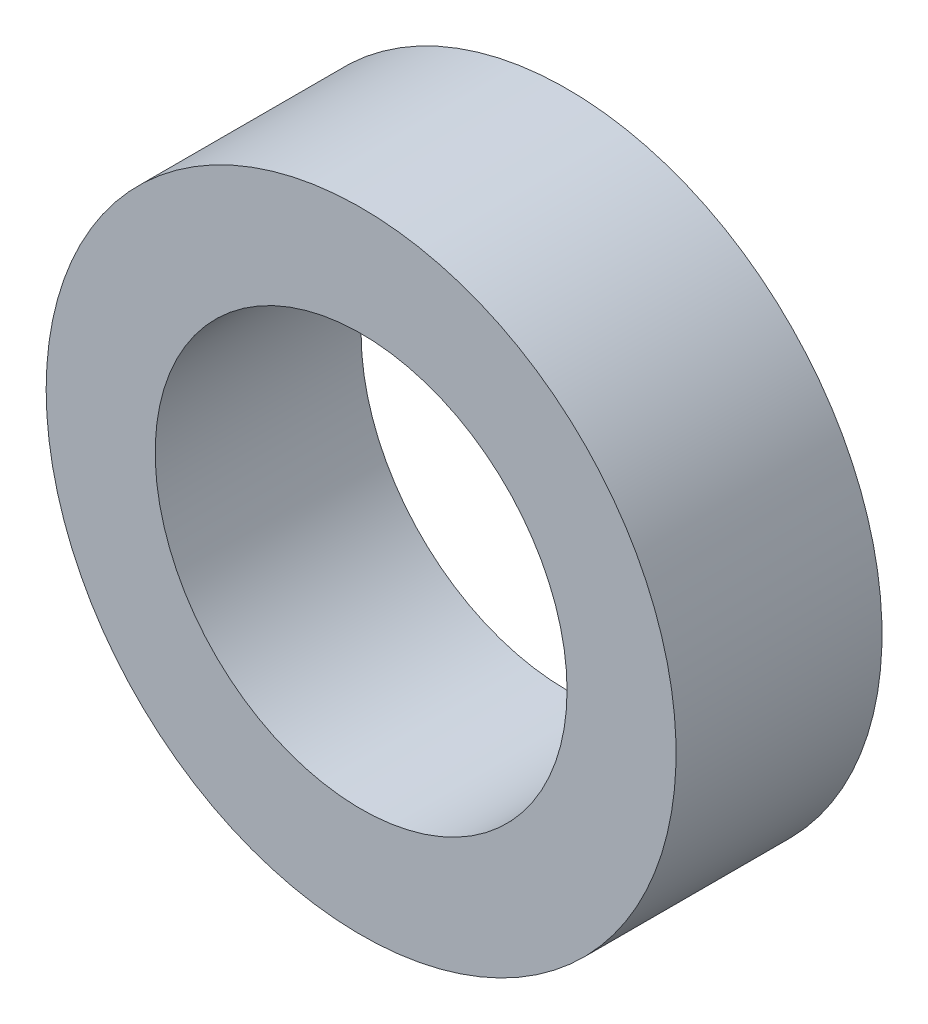
ISO-10303-21;
HEADER;
FILE_DESCRIPTION(('STEP AP214'),'2;1');
FILE_NAME('part.step','',(''),(''),'','','');
FILE_SCHEMA(('AUTOMOTIVE_DESIGN { 1 0 10303 214 1 1 1 1 }'));
ENDSEC;
DATA;
#1=APPLICATION_CONTEXT('core data for automotive mechanical design processes');
#2=APPLICATION_PROTOCOL_DEFINITION('international standard','automotive_design',2000,#1);
#3=PRODUCT_CONTEXT('',#1,'mechanical');
#4=PRODUCT('Part','Part','',(#3));
#5=PRODUCT_RELATED_PRODUCT_CATEGORY('part','',(#4));
#6=PRODUCT_DEFINITION_FORMATION('','',#4);
#7=PRODUCT_DEFINITION_CONTEXT('part definition',#1,'design');
#8=PRODUCT_DEFINITION('design','',#6,#7);
#9=PRODUCT_DEFINITION_SHAPE('','',#8);
#10=(LENGTH_UNIT() NAMED_UNIT(*) SI_UNIT(.MILLI.,.METRE.));
#11=(NAMED_UNIT(*) PLANE_ANGLE_UNIT() SI_UNIT($,.RADIAN.));
#12=(NAMED_UNIT(*) SI_UNIT($,.STERADIAN.) SOLID_ANGLE_UNIT());
#13=UNCERTAINTY_MEASURE_WITH_UNIT(LENGTH_MEASURE(1.E-05),#10,'distance_accuracy_value','');
#14=(GEOMETRIC_REPRESENTATION_CONTEXT(3) GLOBAL_UNCERTAINTY_ASSIGNED_CONTEXT((#13)) GLOBAL_UNIT_ASSIGNED_CONTEXT((#10,
#11,#12)) REPRESENTATION_CONTEXT('',''));
#15=CARTESIAN_POINT('',(0.,0.,0.));
#16=DIRECTION('',(0.,0.,1.));
#17=DIRECTION('',(1.,0.,0.));
#18=AXIS2_PLACEMENT_3D('',#15,#16,#17);
#19=CARTESIAN_POINT('',(0.,0.,-21.));
#20=DIRECTION('',(0.,0.,-1.));
#21=DIRECTION('',(0.,-1.,0.));
#22=AXIS2_PLACEMENT_3D('',#19,#20,#21);
#23=PLANE('',#22);
#24=CARTESIAN_POINT('',(0.,0.,-21.));
#25=DIRECTION('',(0.,0.,-1.));
#26=DIRECTION('',(-1.,0.,0.));
#27=AXIS2_PLACEMENT_3D('',#24,#25,#26);
#28=CIRCLE('',#27,13.);
#29=CARTESIAN_POINT('',(-13.,0.,-21.));
#30=VERTEX_POINT('',#29);
#31=EDGE_CURVE('E33',#30,#30,#28,.T.);
#32=ORIENTED_EDGE('',*,*,#31,.T.);
#33=EDGE_LOOP('',(#32));
#34=FACE_BOUND('',#33,.T.);
#35=CARTESIAN_POINT('',(0.,0.,-21.));
#36=DIRECTION('',(0.,0.,-1.));
#37=DIRECTION('',(-1.,0.,0.));
#38=AXIS2_PLACEMENT_3D('',#35,#36,#37);
#39=CIRCLE('',#38,8.5);
#40=CARTESIAN_POINT('',(-8.5,0.,-21.));
#41=VERTEX_POINT('',#40);
#42=EDGE_CURVE('E19',#41,#41,#39,.F.);
#43=ORIENTED_EDGE('',*,*,#42,.T.);
#44=EDGE_LOOP('',(#43));
#45=FACE_BOUND('',#44,.T.);
#46=ADVANCED_FACE('F15',(#34,#45),#23,.T.);
#47=CARTESIAN_POINT('',(0.,0.,-96.65));
#48=DIRECTION('',(0.,0.,1.));
#49=DIRECTION('',(1.,0.,0.));
#50=AXIS2_PLACEMENT_3D('',#47,#48,#49);
#51=CYLINDRICAL_SURFACE('',#50,13.);
#52=CARTESIAN_POINT('',(0.,0.,-12.5));
#53=DIRECTION('',(0.,0.,-1.));
#54=DIRECTION('',(-1.,0.,0.));
#55=AXIS2_PLACEMENT_3D('',#52,#53,#54);
#56=CIRCLE('',#55,13.);
#57=CARTESIAN_POINT('',(-13.,0.,-12.5));
#58=VERTEX_POINT('',#57);
#59=EDGE_CURVE('E10',#58,#58,#56,.T.);
#60=ORIENTED_EDGE('',*,*,#59,.T.);
#61=EDGE_LOOP('',(#60));
#62=FACE_BOUND('',#61,.T.);
#63=ORIENTED_EDGE('',*,*,#31,.F.);
#64=EDGE_LOOP('',(#63));
#65=FACE_BOUND('',#64,.T.);
#66=ADVANCED_FACE('F17',(#62,#65),#51,.T.);
#67=CARTESIAN_POINT('',(0.,0.,-96.65));
#68=DIRECTION('',(0.,0.,1.));
#69=DIRECTION('',(1.,0.,0.));
#70=AXIS2_PLACEMENT_3D('',#67,#68,#69);
#71=CYLINDRICAL_SURFACE('',#70,8.5);
#72=CARTESIAN_POINT('',(0.,0.,-12.5));
#73=DIRECTION('',(0.,0.,1.));
#74=DIRECTION('',(1.,0.,0.));
#75=AXIS2_PLACEMENT_3D('',#72,#73,#74);
#76=CIRCLE('',#75,8.5);
#77=CARTESIAN_POINT('',(8.5,0.,-12.5));
#78=VERTEX_POINT('',#77);
#79=EDGE_CURVE('E24',#78,#78,#76,.T.);
#80=ORIENTED_EDGE('',*,*,#79,.T.);
#81=EDGE_LOOP('',(#80));
#82=FACE_BOUND('',#81,.T.);
#83=ORIENTED_EDGE('',*,*,#42,.F.);
#84=EDGE_LOOP('',(#83));
#85=FACE_BOUND('',#84,.T.);
#86=ADVANCED_FACE('F45',(#82,#85),#71,.F.);
#87=CARTESIAN_POINT('',(0.,0.,-12.5));
#88=DIRECTION('',(0.,0.,-1.));
#89=DIRECTION('',(-1.,0.,0.));
#90=AXIS2_PLACEMENT_3D('',#87,#88,#89);
#91=PLANE('',#90);
#92=ORIENTED_EDGE('',*,*,#59,.F.);
#93=EDGE_LOOP('',(#92));
#94=FACE_BOUND('',#93,.T.);
#95=ORIENTED_EDGE('',*,*,#79,.F.);
#96=EDGE_LOOP('',(#95));
#97=FACE_BOUND('',#96,.T.);
#98=ADVANCED_FACE('F47',(#94,#97),#91,.F.);
#99=CLOSED_SHELL('',(#46,#66,#86,#98));
#100=MANIFOLD_SOLID_BREP('B1',#99);
#101=ADVANCED_BREP_SHAPE_REPRESENTATION('',(#18,#100),#14);
#102=SHAPE_DEFINITION_REPRESENTATION(#9,#101);
ENDSEC;
END-ISO-10303-21;
